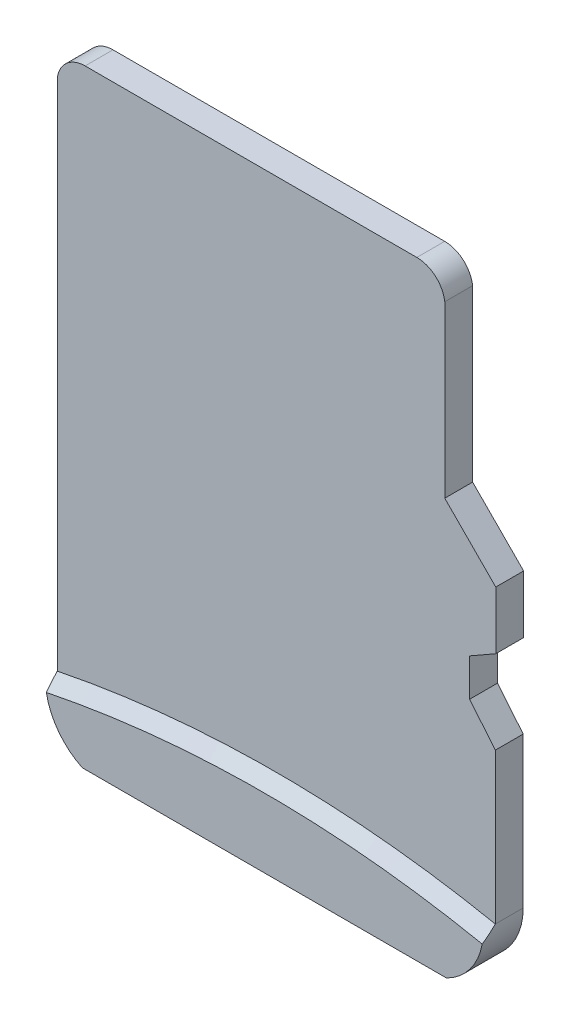
ISO-10303-21;
HEADER;
FILE_DESCRIPTION(('STEP AP214'),'2;1');
FILE_NAME('part.step','',(''),(''),'','','');
FILE_SCHEMA(('AUTOMOTIVE_DESIGN { 1 0 10303 214 1 1 1 1 }'));
ENDSEC;
DATA;
#1=APPLICATION_CONTEXT('core data for automotive mechanical design processes');
#2=APPLICATION_PROTOCOL_DEFINITION('international standard','automotive_design',2000,#1);
#3=PRODUCT_CONTEXT('',#1,'mechanical');
#4=PRODUCT('Part','Part','',(#3));
#5=PRODUCT_RELATED_PRODUCT_CATEGORY('part','',(#4));
#6=PRODUCT_DEFINITION_FORMATION('','',#4);
#7=PRODUCT_DEFINITION_CONTEXT('part definition',#1,'design');
#8=PRODUCT_DEFINITION('design','',#6,#7);
#9=PRODUCT_DEFINITION_SHAPE('','',#8);
#10=(LENGTH_UNIT() NAMED_UNIT(*) SI_UNIT(.MILLI.,.METRE.));
#11=(NAMED_UNIT(*) PLANE_ANGLE_UNIT() SI_UNIT($,.RADIAN.));
#12=(NAMED_UNIT(*) SI_UNIT($,.STERADIAN.) SOLID_ANGLE_UNIT());
#13=UNCERTAINTY_MEASURE_WITH_UNIT(LENGTH_MEASURE(1.E-05),#10,'distance_accuracy_value','');
#14=(GEOMETRIC_REPRESENTATION_CONTEXT(3) GLOBAL_UNCERTAINTY_ASSIGNED_CONTEXT((#13)) GLOBAL_UNIT_ASSIGNED_CONTEXT((#10,
#11,#12)) REPRESENTATION_CONTEXT('',''));
#15=CARTESIAN_POINT('',(0.,0.,0.));
#16=DIRECTION('',(0.,0.,1.));
#17=DIRECTION('',(1.,0.,0.));
#18=AXIS2_PLACEMENT_3D('',#15,#16,#17);
#19=CARTESIAN_POINT('',(23.959933723224,1.91827990787177,0.7));
#20=DIRECTION('',(0.,0.,1.));
#21=DIRECTION('',(1.,0.,0.));
#22=AXIS2_PLACEMENT_3D('',#19,#20,#21);
#23=PLANE('',#22);
#24=DIRECTION('',(2.81346803077018E-13,-1.,0.));
#25=VECTOR('',#24,1.);
#26=CARTESIAN_POINT('',(18.4539327369667,1.91827990787022,0.7));
#27=LINE('',#26,#25);
#28=CARTESIAN_POINT('',(18.4539327369607,23.4203809199612,0.7));
#29=VERTEX_POINT('',#28);
#30=CARTESIAN_POINT('',(18.4539327369643,10.5215618395466,0.7));
#31=VERTEX_POINT('',#30);
#32=EDGE_CURVE('E301',#29,#31,#27,.T.);
#33=ORIENTED_EDGE('',*,*,#32,.T.);
#34=CARTESIAN_POINT('',(23.9545115150179,-16.6696035780589,0.7));
#35=DIRECTION('',(0.,0.,1.));
#36=DIRECTION('',(1.,0.,0.));
#37=AXIS2_PLACEMENT_3D('',#34,#35,#36);
#38=CIRCLE('',#37,27.7419509707079);
#39=CARTESIAN_POINT('',(29.45509029309,10.5215618395429,0.7));
#40=VERTEX_POINT('',#39);
#41=EDGE_CURVE('E189',#31,#40,#38,.F.);
#42=ORIENTED_EDGE('',*,*,#41,.T.);
#43=DIRECTION('',(0.,-1.,0.));
#44=VECTOR('',#43,1.);
#45=CARTESIAN_POINT('',(29.45509029309,1.91827990787177,0.7));
#46=LINE('',#45,#44);
#47=CARTESIAN_POINT('',(29.45509029309,14.3034538287921,0.7));
#48=VERTEX_POINT('',#47);
#49=EDGE_CURVE('E303',#48,#40,#46,.T.);
#50=ORIENTED_EDGE('',*,*,#49,.F.);
#51=DIRECTION('',(0.635619317800836,-0.77200264432086,0.));
#52=VECTOR('',#51,1.);
#53=CARTESIAN_POINT('',(33.3123838453767,9.61850996555319,0.7));
#54=LINE('',#53,#52);
#55=CARTESIAN_POINT('',(28.8096789808155,15.0873495125709,0.7));
#56=VERTEX_POINT('',#55);
#57=EDGE_CURVE('E308',#56,#48,#54,.T.);
#58=ORIENTED_EDGE('',*,*,#57,.F.);
#59=DIRECTION('',(0.,-1.,0.));
#60=VECTOR('',#59,1.);
#61=CARTESIAN_POINT('',(28.8096789808155,1.91827990787177,0.7));
#62=LINE('',#61,#60);
#63=CARTESIAN_POINT('',(28.8096789808155,16.0307991680805,0.7));
#64=VERTEX_POINT('',#63);
#65=EDGE_CURVE('E315',#64,#56,#62,.T.);
#66=ORIENTED_EDGE('',*,*,#65,.F.);
#67=DIRECTION('',(0.868480025401258,0.495724162694366,0.));
#68=VECTOR('',#67,1.);
#69=CARTESIAN_POINT('',(19.075907988012,10.4748101595401,0.7));
#70=LINE('',#69,#68);
#71=CARTESIAN_POINT('',(29.4659653337916,16.4054042174787,0.7));
#72=VERTEX_POINT('',#71);
#73=EDGE_CURVE('E318',#64,#72,#70,.T.);
#74=ORIENTED_EDGE('',*,*,#73,.T.);
#75=DIRECTION('',(0.,-1.,0.));
#76=VECTOR('',#75,1.);
#77=CARTESIAN_POINT('',(29.4659653337916,1.91827990787177,0.7));
#78=LINE('',#77,#76);
#79=CARTESIAN_POINT('',(29.4659653337916,17.8560411369481,0.7));
#80=VERTEX_POINT('',#79);
#81=EDGE_CURVE('E176',#80,#72,#78,.T.);
#82=ORIENTED_EDGE('',*,*,#81,.F.);
#83=DIRECTION('',(0.704184265540735,-0.710017267511753,0.));
#84=VECTOR('',#83,1.);
#85=CARTESIAN_POINT('',(34.7042687489594,12.5743470417543,0.7));
#86=LINE('',#85,#84);
#87=CARTESIAN_POINT('',(28.1850891034887,19.147527308344,0.7));
#88=VERTEX_POINT('',#87);
#89=EDGE_CURVE('E162',#88,#80,#86,.T.);
#90=ORIENTED_EDGE('',*,*,#89,.F.);
#91=DIRECTION('',(-8.54196872922178E-13,-1.,0.));
#92=VECTOR('',#91,1.);
#93=CARTESIAN_POINT('',(28.185089103474,1.91827990786816,0.7));
#94=LINE('',#93,#92);
#95=CARTESIAN_POINT('',(28.1850891034923,23.4203809199116,0.7));
#96=VERTEX_POINT('',#95);
#97=EDGE_CURVE('E174',#96,#88,#94,.T.);
#98=ORIENTED_EDGE('',*,*,#97,.F.);
#99=CARTESIAN_POINT('',(27.4859645810288,23.3283197349789,0.7));
#100=DIRECTION('',(0.,0.,1.));
#101=DIRECTION('',(1.,0.,0.));
#102=AXIS2_PLACEMENT_3D('',#99,#100,#101);
#103=CIRCLE('',#102,0.705159811449334);
#104=CARTESIAN_POINT('',(27.4834451154169,24.0334750455159,0.7));
#105=VERTEX_POINT('',#104);
#106=EDGE_CURVE('E63',#96,#105,#103,.T.);
#107=ORIENTED_EDGE('',*,*,#106,.T.);
#108=DIRECTION('',(0.999999999999854,-5.40305386818244E-07,0.));
#109=VECTOR('',#108,1.);
#110=CARTESIAN_POINT('',(23.9599456721841,24.0334769492816,0.7));
#111=LINE('',#110,#109);
#112=CARTESIAN_POINT('',(19.1530572594242,24.0334795464693,0.7));
#113=VERTEX_POINT('',#112);
#114=EDGE_CURVE('E222',#113,#105,#111,.T.);
#115=ORIENTED_EDGE('',*,*,#114,.F.);
#116=CARTESIAN_POINT('',(19.1530572594242,23.3283197350216,0.7));
#117=DIRECTION('',(0.,0.,1.));
#118=DIRECTION('',(1.,0.,0.));
#119=AXIS2_PLACEMENT_3D('',#116,#117,#118);
#120=CIRCLE('',#119,0.705159811448242);
#121=EDGE_CURVE('E304',#113,#29,#120,.T.);
#122=ORIENTED_EDGE('',*,*,#121,.T.);
#123=EDGE_LOOP('',(#33,#42,#50,#58,#66,#74,#82,#90,#98,#107,#115,#122));
#124=FACE_BOUND('',#123,.T.);
#125=ADVANCED_FACE('F38',(#124),#23,.T.);
#126=CARTESIAN_POINT('',(23.9599456721841,24.0334769492816,0.7));
#127=DIRECTION('',(5.40305386818244E-07,0.999999999999854,0.));
#128=DIRECTION('',(-0.999999999999854,5.40305386818244E-07,0.));
#129=AXIS2_PLACEMENT_3D('',#126,#127,#128);
#130=PLANE('',#129);
#131=DIRECTION('',(0.999999999999854,-5.40305386818244E-07,0.));
#132=VECTOR('',#131,1.);
#133=CARTESIAN_POINT('',(23.9599456721841,24.0334769492816,0.));
#134=LINE('',#133,#132);
#135=CARTESIAN_POINT('',(19.1530572594242,24.0334795464693,0.));
#136=VERTEX_POINT('',#135);
#137=CARTESIAN_POINT('',(27.4834451154169,24.0334750455159,0.));
#138=VERTEX_POINT('',#137);
#139=EDGE_CURVE('E184',#136,#138,#134,.T.);
#140=ORIENTED_EDGE('',*,*,#139,.F.);
#141=DIRECTION('',(0.,0.,-1.));
#142=VECTOR('',#141,1.);
#143=CARTESIAN_POINT('',(19.1530572594242,24.0334795464693,0.7));
#144=LINE('',#143,#142);
#145=EDGE_CURVE('E11',#113,#136,#144,.T.);
#146=ORIENTED_EDGE('',*,*,#145,.F.);
#147=ORIENTED_EDGE('',*,*,#114,.T.);
#148=DIRECTION('',(0.,0.,-1.));
#149=VECTOR('',#148,1.);
#150=CARTESIAN_POINT('',(27.4834451154169,24.0334750455159,0.7));
#151=LINE('',#150,#149);
#152=EDGE_CURVE('E180',#105,#138,#151,.T.);
#153=ORIENTED_EDGE('',*,*,#152,.T.);
#154=EDGE_LOOP('',(#140,#146,#147,#153));
#155=FACE_BOUND('',#154,.T.);
#156=ADVANCED_FACE('F281',(#155),#130,.T.);
#157=CARTESIAN_POINT('',(19.1530572594242,23.3283197350216,0.7));
#158=DIRECTION('',(0.,0.,-1.));
#159=DIRECTION('',(-1.,0.,0.));
#160=AXIS2_PLACEMENT_3D('',#157,#158,#159);
#161=CYLINDRICAL_SURFACE('',#160,0.705159811448242);
#162=CARTESIAN_POINT('',(19.1530572594242,23.3283197350216,0.));
#163=DIRECTION('',(0.,0.,1.));
#164=DIRECTION('',(1.,0.,0.));
#165=AXIS2_PLACEMENT_3D('',#162,#163,#164);
#166=CIRCLE('',#165,0.705159811448242);
#167=CARTESIAN_POINT('',(18.4539327369607,23.4203809199612,0.));
#168=VERTEX_POINT('',#167);
#169=EDGE_CURVE('E188',#136,#168,#166,.T.);
#170=ORIENTED_EDGE('',*,*,#169,.T.);
#171=DIRECTION('',(0.,0.,-1.));
#172=VECTOR('',#171,1.);
#173=CARTESIAN_POINT('',(18.4539327369607,23.4203809199612,0.7));
#174=LINE('',#173,#172);
#175=EDGE_CURVE('E54',#29,#168,#174,.T.);
#176=ORIENTED_EDGE('',*,*,#175,.F.);
#177=ORIENTED_EDGE('',*,*,#121,.F.);
#178=ORIENTED_EDGE('',*,*,#145,.T.);
#179=EDGE_LOOP('',(#170,#176,#177,#178));
#180=FACE_BOUND('',#179,.T.);
#181=ADVANCED_FACE('F278',(#180),#161,.T.);
#182=CARTESIAN_POINT('',(18.4539327369667,1.91827990787022,0.7));
#183=DIRECTION('',(1.,2.81346803077018E-13,0.));
#184=DIRECTION('',(-2.81346803077018E-13,1.,0.));
#185=AXIS2_PLACEMENT_3D('',#182,#183,#184);
#186=PLANE('',#185);
#187=DIRECTION('',(2.81346803077018E-13,-1.,0.));
#188=VECTOR('',#187,1.);
#189=CARTESIAN_POINT('',(18.4539327369667,1.91827990787022,0.));
#190=LINE('',#189,#188);
#191=CARTESIAN_POINT('',(18.4539327369643,10.5215618395466,0.));
#192=VERTEX_POINT('',#191);
#193=EDGE_CURVE('E191',#168,#192,#190,.T.);
#194=ORIENTED_EDGE('',*,*,#193,.T.);
#195=DIRECTION('',(0.,0.,-1.));
#196=VECTOR('',#195,1.);
#197=CARTESIAN_POINT('',(18.4539327369643,10.5215618395466,0.7));
#198=LINE('',#197,#196);
#199=EDGE_CURVE('E243',#31,#192,#198,.T.);
#200=ORIENTED_EDGE('',*,*,#199,.F.);
#201=ORIENTED_EDGE('',*,*,#32,.F.);
#202=ORIENTED_EDGE('',*,*,#175,.T.);
#203=EDGE_LOOP('',(#194,#200,#201,#202));
#204=FACE_BOUND('',#203,.T.);
#205=ADVANCED_FACE('F274',(#204),#186,.F.);
#206=CARTESIAN_POINT('',(20.0948226540754,10.5115367125023,0.7));
#207=DIRECTION('',(0.,0.,-1.));
#208=DIRECTION('',(-1.,0.,0.));
#209=AXIS2_PLACEMENT_3D('',#206,#207,#208);
#210=CYLINDRICAL_SURFACE('',#209,1.64092054141899);
#211=CARTESIAN_POINT('',(20.0948226540754,10.5115367125023,0.));
#212=DIRECTION('',(0.,0.,1.));
#213=DIRECTION('',(1.,0.,0.));
#214=AXIS2_PLACEMENT_3D('',#211,#212,#213);
#215=CIRCLE('',#214,1.64092054141899);
#216=CARTESIAN_POINT('',(19.3820795486301,9.033491554568,0.));
#217=VERTEX_POINT('',#216);
#218=EDGE_CURVE('E193',#192,#217,#215,.T.);
#219=ORIENTED_EDGE('',*,*,#218,.T.);
#220=DIRECTION('',(0.,0.,-1.));
#221=VECTOR('',#220,1.);
#222=CARTESIAN_POINT('',(19.3820795486301,9.033491554568,0.7));
#223=LINE('',#222,#221);
#224=CARTESIAN_POINT('',(19.3820795486301,9.033491554568,1.));
#225=VERTEX_POINT('',#224);
#226=EDGE_CURVE('E239',#225,#217,#223,.T.);
#227=ORIENTED_EDGE('',*,*,#226,.F.);
#228=CARTESIAN_POINT('',(20.0948226540753,10.511536712501,1.));
#229=DIRECTION('',(0.,0.,1.));
#230=DIRECTION('',(-1.,0.,0.));
#231=AXIS2_PLACEMENT_3D('',#228,#229,#230);
#232=CIRCLE('',#231,1.64092054141835);
#233=CARTESIAN_POINT('',(18.4798795363341,10.2207121095025,1.));
#234=VERTEX_POINT('',#233);
#235=EDGE_CURVE('E251',#234,#225,#232,.T.);
#236=ORIENTED_EDGE('',*,*,#235,.F.);
#237=CARTESIAN_POINT('',(18.4798795363341,10.2207121095025,1.));
#238=CARTESIAN_POINT('',(18.4709542851157,10.2701930916234,0.949735408039186));
#239=CARTESIAN_POINT('',(18.4643294262255,10.3200043935154,0.899603112064133));
#240=CARTESIAN_POINT('',(18.4556804931001,10.4202876368632,0.799603112064017));
#241=CARTESIAN_POINT('',(18.4536564188668,10.4707595783192,0.749735408039069));
#242=CARTESIAN_POINT('',(18.4539327369638,10.5215618395465,0.699999999999996));
#243=B_SPLINE_CURVE_WITH_KNOTS('',3,(#237,#238,#239,#240,#241,#242),.UNSPECIFIED.,.F.,.F.,(4,2,
4),(0.,0.212942985000667,0.425885970093028),.UNSPECIFIED.);
#244=EDGE_CURVE('E43',#234,#31,#243,.T.);
#245=ORIENTED_EDGE('',*,*,#244,.T.);
#246=ORIENTED_EDGE('',*,*,#199,.T.);
#247=EDGE_LOOP('',(#219,#227,#236,#245,#246));
#248=FACE_BOUND('',#247,.T.);
#249=ADVANCED_FACE('F270',(#248),#210,.T.);
#250=CARTESIAN_POINT('',(23.9599337232889,9.03349155452627,0.7));
#251=DIRECTION('',(9.11516377739171E-12,1.,0.));
#252=DIRECTION('',(-1.,9.11516377739171E-12,0.));
#253=AXIS2_PLACEMENT_3D('',#250,#251,#252);
#254=PLANE('',#253);
#255=DIRECTION('',(1.,-9.11516377739171E-12,0.));
#256=VECTOR('',#255,1.);
#257=CARTESIAN_POINT('',(23.9599337232889,9.03349155452627,0.));
#258=LINE('',#257,#256);
#259=CARTESIAN_POINT('',(28.526943481233,9.03349155448464,0.));
#260=VERTEX_POINT('',#259);
#261=EDGE_CURVE('E195',#217,#260,#258,.T.);
#262=ORIENTED_EDGE('',*,*,#261,.T.);
#263=DIRECTION('',(0.,0.,-1.));
#264=VECTOR('',#263,1.);
#265=CARTESIAN_POINT('',(28.526943481233,9.03349155448464,0.7));
#266=LINE('',#265,#264);
#267=CARTESIAN_POINT('',(28.526943481233,9.03349155448464,1.));
#268=VERTEX_POINT('',#267);
#269=EDGE_CURVE('E127',#268,#260,#266,.T.);
#270=ORIENTED_EDGE('',*,*,#269,.F.);
#271=DIRECTION('',(1.,-9.11516377739171E-12,0.));
#272=VECTOR('',#271,1.);
#273=CARTESIAN_POINT('',(19.3820795486301,9.033491554568,1.));
#274=LINE('',#273,#272);
#275=EDGE_CURVE('E250',#225,#268,#274,.T.);
#276=ORIENTED_EDGE('',*,*,#275,.F.);
#277=ORIENTED_EDGE('',*,*,#226,.T.);
#278=EDGE_LOOP('',(#262,#270,#276,#277));
#279=FACE_BOUND('',#278,.T.);
#280=ADVANCED_FACE('F266',(#279),#254,.F.);
#281=CARTESIAN_POINT('',(27.7888285020603,10.5273617875264,0.7));
#282=DIRECTION('',(0.,0.,-1.));
#283=DIRECTION('',(-1.,0.,0.));
#284=AXIS2_PLACEMENT_3D('',#281,#282,#283);
#285=CYLINDRICAL_SURFACE('',#284,1.66627188527104);
#286=CARTESIAN_POINT('',(27.7888285020603,10.5273617875264,0.));
#287=DIRECTION('',(0.,0.,1.));
#288=DIRECTION('',(1.,0.,0.));
#289=AXIS2_PLACEMENT_3D('',#286,#287,#288);
#290=CIRCLE('',#289,1.66627188527104);
#291=CARTESIAN_POINT('',(29.45509029309,10.5215618395429,0.));
#292=VERTEX_POINT('',#291);
#293=EDGE_CURVE('E197',#260,#292,#290,.T.);
#294=ORIENTED_EDGE('',*,*,#293,.T.);
#295=DIRECTION('',(0.,0.,-1.));
#296=VECTOR('',#295,1.);
#297=CARTESIAN_POINT('',(29.45509029309,10.5215618395429,0.7));
#298=LINE('',#297,#296);
#299=EDGE_CURVE('E234',#40,#292,#298,.T.);
#300=ORIENTED_EDGE('',*,*,#299,.F.);
#301=CARTESIAN_POINT('',(29.2537860070381,9.7334087005911,1.51238789351859));
#302=CARTESIAN_POINT('',(29.2803801731756,9.78251047923255,1.45901144865288));
#303=CARTESIAN_POINT('',(29.3043177233163,9.83253824211502,1.40523804850298));
#304=CARTESIAN_POINT('',(29.3469379449529,9.93422600016491,1.29711943171935));
#305=CARTESIAN_POINT('',(29.3656190381277,9.98588648040922,1.24277404841069));
#306=CARTESIAN_POINT('',(29.4134321716254,10.1416018398551,1.08065709052752));
#307=CARTESIAN_POINT('',(29.4350107566258,10.2476605123627,0.972425538884719));
#308=CARTESIAN_POINT('',(29.4490375362642,10.3826825061088,0.83731364337082));
#309=CARTESIAN_POINT('',(29.4512137993634,10.410286147514,0.809829245481));
#310=CARTESIAN_POINT('',(29.4541932084279,10.4657536303997,0.754876564047817));
#311=CARTESIAN_POINT('',(29.454992069985,10.4936180136675,0.727408595503557));
#312=CARTESIAN_POINT('',(29.4550902930909,10.5215618395428,0.699999999999919));
#313=B_SPLINE_CURVE_WITH_KNOTS('',3,(#301,#302,#303,#304,#305,#306,#307,#308,#309,#310,#311,
#312),.UNSPECIFIED.,.F.,.F.,(4,2,2,2,2,4),(0.,0.231595135453855,0.46325973639887,
0.920658272538868,1.03768812061169,1.15508133777267),.UNSPECIFIED.);
#314=CARTESIAN_POINT('',(29.4267322637467,10.2212029021476,1.));
#315=VERTEX_POINT('',#314);
#316=EDGE_CURVE('E254',#315,#40,#313,.T.);
#317=ORIENTED_EDGE('',*,*,#316,.F.);
#318=CARTESIAN_POINT('',(27.7888285020592,10.5273617875253,1.));
#319=DIRECTION('',(0.,0.,1.));
#320=DIRECTION('',(-1.,0.,0.));
#321=AXIS2_PLACEMENT_3D('',#318,#319,#320);
#322=CIRCLE('',#321,1.66627188527133);
#323=EDGE_CURVE('E119',#268,#315,#322,.T.);
#324=ORIENTED_EDGE('',*,*,#323,.F.);
#325=ORIENTED_EDGE('',*,*,#269,.T.);
#326=EDGE_LOOP('',(#294,#300,#317,#324,#325));
#327=FACE_BOUND('',#326,.T.);
#328=ADVANCED_FACE('F260',(#327),#285,.T.);
#329=CARTESIAN_POINT('',(29.45509029309,1.91827990787177,0.7));
#330=DIRECTION('',(1.,0.,0.));
#331=DIRECTION('',(0.,0.,-1.));
#332=AXIS2_PLACEMENT_3D('',#329,#330,#331);
#333=PLANE('',#332);
#334=DIRECTION('',(0.,-1.,0.));
#335=VECTOR('',#334,1.);
#336=CARTESIAN_POINT('',(29.45509029309,1.91827990787177,0.));
#337=LINE('',#336,#335);
#338=CARTESIAN_POINT('',(29.45509029309,14.3034538287921,0.));
#339=VERTEX_POINT('',#338);
#340=EDGE_CURVE('E200',#339,#292,#337,.T.);
#341=ORIENTED_EDGE('',*,*,#340,.F.);
#342=DIRECTION('',(0.,0.,-1.));
#343=VECTOR('',#342,1.);
#344=CARTESIAN_POINT('',(29.45509029309,14.3034538287921,0.7));
#345=LINE('',#344,#343);
#346=EDGE_CURVE('E232',#48,#339,#345,.T.);
#347=ORIENTED_EDGE('',*,*,#346,.F.);
#348=ORIENTED_EDGE('',*,*,#49,.T.);
#349=ORIENTED_EDGE('',*,*,#299,.T.);
#350=EDGE_LOOP('',(#341,#347,#348,#349));
#351=FACE_BOUND('',#350,.T.);
#352=ADVANCED_FACE('F265',(#351),#333,.T.);
#353=CARTESIAN_POINT('',(33.3123838453767,9.61850996555319,0.7));
#354=DIRECTION('',(0.77200264432086,0.635619317800836,0.));
#355=DIRECTION('',(-0.635619317800836,0.77200264432086,0.));
#356=AXIS2_PLACEMENT_3D('',#353,#354,#355);
#357=PLANE('',#356);
#358=DIRECTION('',(0.635619317800836,-0.77200264432086,0.));
#359=VECTOR('',#358,1.);
#360=CARTESIAN_POINT('',(33.3123838453767,9.61850996555319,0.));
#361=LINE('',#360,#359);
#362=CARTESIAN_POINT('',(28.8096789808155,15.0873495125709,0.));
#363=VERTEX_POINT('',#362);
#364=EDGE_CURVE('E204',#363,#339,#361,.T.);
#365=ORIENTED_EDGE('',*,*,#364,.F.);
#366=DIRECTION('',(0.,0.,-1.));
#367=VECTOR('',#366,1.);
#368=CARTESIAN_POINT('',(28.8096789808155,15.0873495125709,0.7));
#369=LINE('',#368,#367);
#370=EDGE_CURVE('E230',#56,#363,#369,.T.);
#371=ORIENTED_EDGE('',*,*,#370,.F.);
#372=ORIENTED_EDGE('',*,*,#57,.T.);
#373=ORIENTED_EDGE('',*,*,#346,.T.);
#374=EDGE_LOOP('',(#365,#371,#372,#373));
#375=FACE_BOUND('',#374,.T.);
#376=ADVANCED_FACE('F333',(#375),#357,.T.);
#377=CARTESIAN_POINT('',(28.8096789808155,1.91827990787177,0.7));
#378=DIRECTION('',(1.,0.,0.));
#379=DIRECTION('',(0.,0.,-1.));
#380=AXIS2_PLACEMENT_3D('',#377,#378,#379);
#381=PLANE('',#380);
#382=DIRECTION('',(0.,-1.,0.));
#383=VECTOR('',#382,1.);
#384=CARTESIAN_POINT('',(28.8096789808155,1.91827990787177,0.));
#385=LINE('',#384,#383);
#386=CARTESIAN_POINT('',(28.8096789808155,16.0307991680805,0.));
#387=VERTEX_POINT('',#386);
#388=EDGE_CURVE('E207',#387,#363,#385,.T.);
#389=ORIENTED_EDGE('',*,*,#388,.F.);
#390=DIRECTION('',(0.,0.,-1.));
#391=VECTOR('',#390,1.);
#392=CARTESIAN_POINT('',(28.8096789808155,16.0307991680805,0.7));
#393=LINE('',#392,#391);
#394=EDGE_CURVE('E228',#64,#387,#393,.T.);
#395=ORIENTED_EDGE('',*,*,#394,.F.);
#396=ORIENTED_EDGE('',*,*,#65,.T.);
#397=ORIENTED_EDGE('',*,*,#370,.T.);
#398=EDGE_LOOP('',(#389,#395,#396,#397));
#399=FACE_BOUND('',#398,.T.);
#400=ADVANCED_FACE('F327',(#399),#381,.T.);
#401=CARTESIAN_POINT('',(19.075907988012,10.4748101595401,0.7));
#402=DIRECTION('',(-0.495724162694366,0.868480025401258,0.));
#403=DIRECTION('',(-0.868480025401258,-0.495724162694366,0.));
#404=AXIS2_PLACEMENT_3D('',#401,#402,#403);
#405=PLANE('',#404);
#406=DIRECTION('',(0.868480025401258,0.495724162694366,0.));
#407=VECTOR('',#406,1.);
#408=CARTESIAN_POINT('',(19.075907988012,10.4748101595401,0.));
#409=LINE('',#408,#407);
#410=CARTESIAN_POINT('',(29.4659653337916,16.4054042174787,0.));
#411=VERTEX_POINT('',#410);
#412=EDGE_CURVE('E210',#387,#411,#409,.T.);
#413=ORIENTED_EDGE('',*,*,#412,.T.);
#414=DIRECTION('',(0.,0.,-1.));
#415=VECTOR('',#414,1.);
#416=CARTESIAN_POINT('',(29.4659653337916,16.4054042174787,0.7));
#417=LINE('',#416,#415);
#418=EDGE_CURVE('E226',#72,#411,#417,.T.);
#419=ORIENTED_EDGE('',*,*,#418,.F.);
#420=ORIENTED_EDGE('',*,*,#73,.F.);
#421=ORIENTED_EDGE('',*,*,#394,.T.);
#422=EDGE_LOOP('',(#413,#419,#420,#421));
#423=FACE_BOUND('',#422,.T.);
#424=ADVANCED_FACE('F358',(#423),#405,.F.);
#425=CARTESIAN_POINT('',(29.4659653337916,1.91827990787177,0.7));
#426=DIRECTION('',(1.,0.,0.));
#427=DIRECTION('',(0.,0.,-1.));
#428=AXIS2_PLACEMENT_3D('',#425,#426,#427);
#429=PLANE('',#428);
#430=DIRECTION('',(0.,-1.,0.));
#431=VECTOR('',#430,1.);
#432=CARTESIAN_POINT('',(29.4659653337916,1.91827990787177,0.));
#433=LINE('',#432,#431);
#434=CARTESIAN_POINT('',(29.4659653337916,17.8560411369481,0.));
#435=VERTEX_POINT('',#434);
#436=EDGE_CURVE('E213',#435,#411,#433,.T.);
#437=ORIENTED_EDGE('',*,*,#436,.F.);
#438=DIRECTION('',(0.,0.,-1.));
#439=VECTOR('',#438,1.);
#440=CARTESIAN_POINT('',(29.4659653337916,17.8560411369481,0.7));
#441=LINE('',#440,#439);
#442=EDGE_CURVE('E169',#80,#435,#441,.T.);
#443=ORIENTED_EDGE('',*,*,#442,.F.);
#444=ORIENTED_EDGE('',*,*,#81,.T.);
#445=ORIENTED_EDGE('',*,*,#418,.T.);
#446=EDGE_LOOP('',(#437,#443,#444,#445));
#447=FACE_BOUND('',#446,.T.);
#448=ADVANCED_FACE('F321',(#447),#429,.T.);
#449=CARTESIAN_POINT('',(34.7042687489594,12.5743470417543,0.7));
#450=DIRECTION('',(0.710017267511753,0.704184265540735,0.));
#451=DIRECTION('',(-0.704184265540735,0.710017267511753,0.));
#452=AXIS2_PLACEMENT_3D('',#449,#450,#451);
#453=PLANE('',#452);
#454=DIRECTION('',(0.704184265540735,-0.710017267511753,0.));
#455=VECTOR('',#454,1.);
#456=CARTESIAN_POINT('',(34.7042687489594,12.5743470417543,0.));
#457=LINE('',#456,#455);
#458=CARTESIAN_POINT('',(28.1850891034887,19.147527308344,0.));
#459=VERTEX_POINT('',#458);
#460=EDGE_CURVE('E164',#459,#435,#457,.T.);
#461=ORIENTED_EDGE('',*,*,#460,.F.);
#462=DIRECTION('',(0.,0.,-1.));
#463=VECTOR('',#462,1.);
#464=CARTESIAN_POINT('',(28.1850891034887,19.147527308344,0.7));
#465=LINE('',#464,#463);
#466=EDGE_CURVE('E159',#88,#459,#465,.T.);
#467=ORIENTED_EDGE('',*,*,#466,.F.);
#468=ORIENTED_EDGE('',*,*,#89,.T.);
#469=ORIENTED_EDGE('',*,*,#442,.T.);
#470=EDGE_LOOP('',(#461,#467,#468,#469));
#471=FACE_BOUND('',#470,.T.);
#472=ADVANCED_FACE('F161',(#471),#453,.T.);
#473=CARTESIAN_POINT('',(28.185089103474,1.91827990786816,0.7));
#474=DIRECTION('',(1.,-8.54196872922178E-13,0.));
#475=DIRECTION('',(8.54196872922178E-13,1.,0.));
#476=AXIS2_PLACEMENT_3D('',#473,#474,#475);
#477=PLANE('',#476);
#478=DIRECTION('',(-8.54196872922178E-13,-1.,0.));
#479=VECTOR('',#478,1.);
#480=CARTESIAN_POINT('',(28.185089103474,1.91827990786816,0.));
#481=LINE('',#480,#479);
#482=CARTESIAN_POINT('',(28.1850891034923,23.4203809199116,0.));
#483=VERTEX_POINT('',#482);
#484=EDGE_CURVE('E217',#483,#459,#481,.T.);
#485=ORIENTED_EDGE('',*,*,#484,.F.);
#486=DIRECTION('',(0.,0.,-1.));
#487=VECTOR('',#486,1.);
#488=CARTESIAN_POINT('',(28.1850891034923,23.4203809199116,0.7));
#489=LINE('',#488,#487);
#490=EDGE_CURVE('E170',#96,#483,#489,.T.);
#491=ORIENTED_EDGE('',*,*,#490,.F.);
#492=ORIENTED_EDGE('',*,*,#97,.T.);
#493=ORIENTED_EDGE('',*,*,#466,.T.);
#494=EDGE_LOOP('',(#485,#491,#492,#493));
#495=FACE_BOUND('',#494,.T.);
#496=ADVANCED_FACE('F178',(#495),#477,.T.);
#497=CARTESIAN_POINT('',(27.4859645810288,23.3283197349789,0.7));
#498=DIRECTION('',(0.,0.,-1.));
#499=DIRECTION('',(-1.,0.,0.));
#500=AXIS2_PLACEMENT_3D('',#497,#498,#499);
#501=CYLINDRICAL_SURFACE('',#500,0.705159811449334);
#502=CARTESIAN_POINT('',(27.4859645810288,23.3283197349789,0.));
#503=DIRECTION('',(0.,0.,1.));
#504=DIRECTION('',(1.,0.,0.));
#505=AXIS2_PLACEMENT_3D('',#502,#503,#504);
#506=CIRCLE('',#505,0.705159811449334);
#507=EDGE_CURVE('E219',#483,#138,#506,.T.);
#508=ORIENTED_EDGE('',*,*,#507,.T.);
#509=ORIENTED_EDGE('',*,*,#152,.F.);
#510=ORIENTED_EDGE('',*,*,#106,.F.);
#511=ORIENTED_EDGE('',*,*,#490,.T.);
#512=EDGE_LOOP('',(#508,#509,#510,#511));
#513=FACE_BOUND('',#512,.T.);
#514=ADVANCED_FACE('F435',(#513),#501,.T.);
#515=CARTESIAN_POINT('',(23.959933723224,1.91827990787177,0.));
#516=DIRECTION('',(0.,0.,1.));
#517=DIRECTION('',(1.,0.,0.));
#518=AXIS2_PLACEMENT_3D('',#515,#516,#517);
#519=PLANE('',#518);
#520=ORIENTED_EDGE('',*,*,#218,.F.);
#521=ORIENTED_EDGE('',*,*,#193,.F.);
#522=ORIENTED_EDGE('',*,*,#169,.F.);
#523=ORIENTED_EDGE('',*,*,#139,.T.);
#524=ORIENTED_EDGE('',*,*,#507,.F.);
#525=ORIENTED_EDGE('',*,*,#484,.T.);
#526=ORIENTED_EDGE('',*,*,#460,.T.);
#527=ORIENTED_EDGE('',*,*,#436,.T.);
#528=ORIENTED_EDGE('',*,*,#412,.F.);
#529=ORIENTED_EDGE('',*,*,#388,.T.);
#530=ORIENTED_EDGE('',*,*,#364,.T.);
#531=ORIENTED_EDGE('',*,*,#340,.T.);
#532=ORIENTED_EDGE('',*,*,#293,.F.);
#533=ORIENTED_EDGE('',*,*,#261,.F.);
#534=EDGE_LOOP('',(#520,#521,#522,#523,#524,#525,#526,#527,#528,#529,#530,#531,#532,#533));
#535=FACE_BOUND('',#534,.T.);
#536=ADVANCED_FACE('F296',(#535),#519,.F.);
#537=CARTESIAN_POINT('',(23.9545115150179,-16.6696035780589,0.7));
#538=DIRECTION('',(0.,0.,-1.));
#539=DIRECTION('',(1.,0.,0.));
#540=AXIS2_PLACEMENT_3D('',#537,#538,#539);
#541=CONICAL_SURFACE('',#540,27.7419509707079,0.78539816339745);
#542=ORIENTED_EDGE('',*,*,#41,.F.);
#543=ORIENTED_EDGE('',*,*,#244,.F.);
#544=CARTESIAN_POINT('',(23.9545115150179,-16.6696035780589,1.));
#545=DIRECTION('',(0.,0.,-1.));
#546=DIRECTION('',(-1.,0.,0.));
#547=AXIS2_PLACEMENT_3D('',#544,#545,#546);
#548=CIRCLE('',#547,27.4419509707079);
#549=EDGE_CURVE('E249',#315,#234,#548,.F.);
#550=ORIENTED_EDGE('',*,*,#549,.F.);
#551=ORIENTED_EDGE('',*,*,#316,.T.);
#552=EDGE_LOOP('',(#542,#543,#550,#551));
#553=FACE_BOUND('',#552,.T.);
#554=ADVANCED_FACE('F40',(#553),#541,.T.);
#555=CARTESIAN_POINT('',(20.0948226540753,10.511536712501,1.));
#556=DIRECTION('',(0.,0.,-1.));
#557=DIRECTION('',(-1.,0.,0.));
#558=AXIS2_PLACEMENT_3D('',#555,#556,#557);
#559=PLANE('',#558);
#560=ORIENTED_EDGE('',*,*,#235,.T.);
#561=ORIENTED_EDGE('',*,*,#275,.T.);
#562=ORIENTED_EDGE('',*,*,#323,.T.);
#563=ORIENTED_EDGE('',*,*,#549,.T.);
#564=EDGE_LOOP('',(#560,#561,#562,#563));
#565=FACE_BOUND('',#564,.T.);
#566=ADVANCED_FACE('F348',(#565),#559,.F.);
#567=CLOSED_SHELL('',(#125,#156,#181,#205,#249,#280,#328,#352,#376,#400,#424,#448,#472,#496,
#514,#536,#554,#566));
#568=MANIFOLD_SOLID_BREP('B2',#567);
#569=ADVANCED_BREP_SHAPE_REPRESENTATION('',(#18,#568),#14);
#570=SHAPE_DEFINITION_REPRESENTATION(#9,#569);
ENDSEC;
END-ISO-10303-21;
